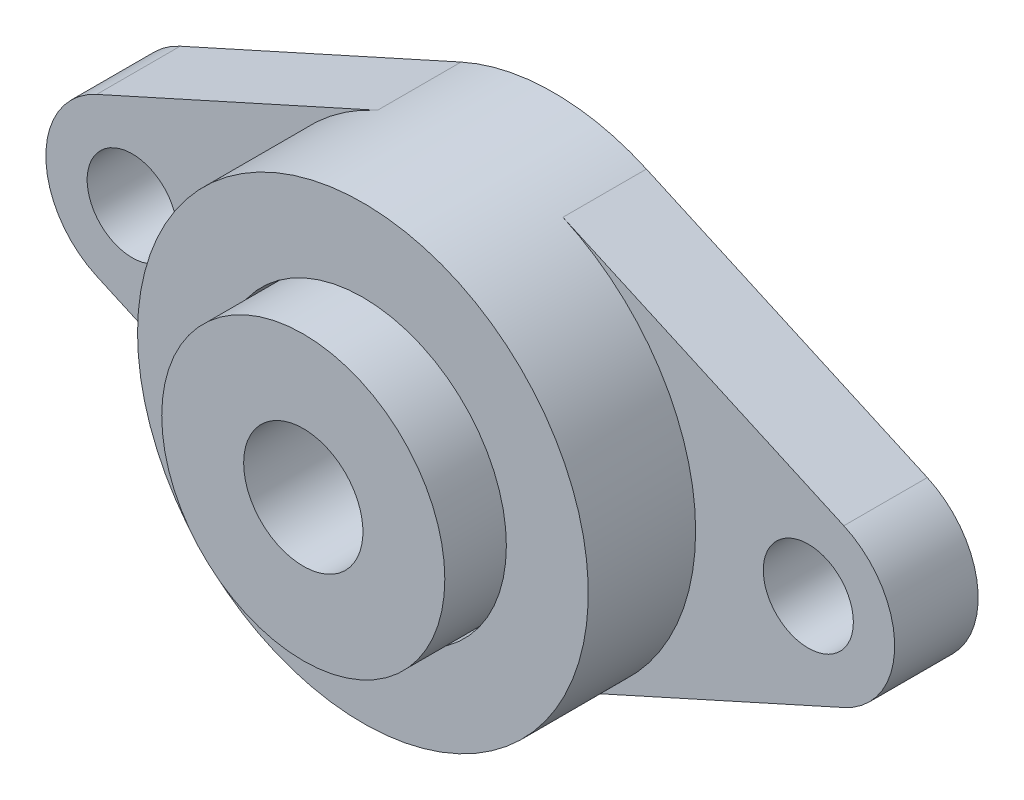
ISO-10303-21;
HEADER;
FILE_DESCRIPTION(('STEP AP214'),'2;1');
FILE_NAME('part.step','',(''),(''),'','','');
FILE_SCHEMA(('AUTOMOTIVE_DESIGN { 1 0 10303 214 1 1 1 1 }'));
ENDSEC;
DATA;
#1=APPLICATION_CONTEXT('core data for automotive mechanical design processes');
#2=APPLICATION_PROTOCOL_DEFINITION('international standard','automotive_design',2000,#1);
#3=PRODUCT_CONTEXT('',#1,'mechanical');
#4=PRODUCT('Part','Part','',(#3));
#5=PRODUCT_RELATED_PRODUCT_CATEGORY('part','',(#4));
#6=PRODUCT_DEFINITION_FORMATION('','',#4);
#7=PRODUCT_DEFINITION_CONTEXT('part definition',#1,'design');
#8=PRODUCT_DEFINITION('design','',#6,#7);
#9=PRODUCT_DEFINITION_SHAPE('','',#8);
#10=(LENGTH_UNIT() NAMED_UNIT(*) SI_UNIT(.MILLI.,.METRE.));
#11=(NAMED_UNIT(*) PLANE_ANGLE_UNIT() SI_UNIT($,.RADIAN.));
#12=(NAMED_UNIT(*) SI_UNIT($,.STERADIAN.) SOLID_ANGLE_UNIT());
#13=UNCERTAINTY_MEASURE_WITH_UNIT(LENGTH_MEASURE(1.E-05),#10,'distance_accuracy_value','');
#14=(GEOMETRIC_REPRESENTATION_CONTEXT(3) GLOBAL_UNCERTAINTY_ASSIGNED_CONTEXT((#13)) GLOBAL_UNIT_ASSIGNED_CONTEXT((#10,
#11,#12)) REPRESENTATION_CONTEXT('',''));
#15=CARTESIAN_POINT('',(0.,0.,0.));
#16=DIRECTION('',(0.,0.,1.));
#17=DIRECTION('',(1.,0.,0.));
#18=AXIS2_PLACEMENT_3D('',#15,#16,#17);
#19=CARTESIAN_POINT('',(0.,18.84045,33.3375));
#20=DIRECTION('',(0.,0.,1.));
#21=DIRECTION('',(1.,0.,0.));
#22=AXIS2_PLACEMENT_3D('',#19,#20,#21);
#23=PLANE('',#22);
#24=CARTESIAN_POINT('',(0.,0.,33.3375));
#25=DIRECTION('',(0.,0.,-1.));
#26=DIRECTION('',(-1.,0.,0.));
#27=AXIS2_PLACEMENT_3D('',#24,#25,#26);
#28=CIRCLE('',#27,7.9375);
#29=CARTESIAN_POINT('',(-7.9375,0.,33.3375));
#30=VERTEX_POINT('',#29);
#31=EDGE_CURVE('E11',#30,#30,#28,.T.);
#32=ORIENTED_EDGE('',*,*,#31,.T.);
#33=EDGE_LOOP('',(#32));
#34=FACE_BOUND('',#33,.T.);
#35=CARTESIAN_POINT('',(0.,0.,33.3375));
#36=DIRECTION('',(0.,0.,-1.));
#37=DIRECTION('',(-1.,0.,0.));
#38=AXIS2_PLACEMENT_3D('',#35,#36,#37);
#39=CIRCLE('',#38,18.84045);
#40=CARTESIAN_POINT('',(-18.84045,0.,33.3375));
#41=VERTEX_POINT('',#40);
#42=EDGE_CURVE('E75',#41,#41,#39,.T.);
#43=ORIENTED_EDGE('',*,*,#42,.F.);
#44=EDGE_LOOP('',(#43));
#45=FACE_BOUND('',#44,.T.);
#46=ADVANCED_FACE('F53',(#34,#45),#23,.T.);
#47=CARTESIAN_POINT('',(0.,0.,0.));
#48=DIRECTION('',(0.,0.,-1.));
#49=DIRECTION('',(-1.,0.,0.));
#50=AXIS2_PLACEMENT_3D('',#47,#48,#49);
#51=CYLINDRICAL_SURFACE('',#50,7.9375);
#52=CARTESIAN_POINT('',(0.,0.,1.5875));
#53=DIRECTION('',(0.,0.,-1.));
#54=DIRECTION('',(-1.,0.,0.));
#55=AXIS2_PLACEMENT_3D('',#52,#53,#54);
#56=CIRCLE('',#55,7.9375);
#57=CARTESIAN_POINT('',(-7.9375,0.,1.5875));
#58=VERTEX_POINT('',#57);
#59=EDGE_CURVE('E59',#58,#58,#56,.T.);
#60=ORIENTED_EDGE('',*,*,#59,.T.);
#61=EDGE_LOOP('',(#60));
#62=FACE_BOUND('',#61,.T.);
#63=ORIENTED_EDGE('',*,*,#31,.F.);
#64=EDGE_LOOP('',(#63));
#65=FACE_BOUND('',#64,.T.);
#66=ADVANCED_FACE('F83',(#62,#65),#51,.F.);
#67=CARTESIAN_POINT('',(0.,18.84045,1.5875));
#68=DIRECTION('',(0.,0.,-1.));
#69=DIRECTION('',(-1.,0.,0.));
#70=AXIS2_PLACEMENT_3D('',#67,#68,#69);
#71=PLANE('',#70);
#72=CARTESIAN_POINT('',(0.,0.,1.5875));
#73=DIRECTION('',(0.,0.,-1.));
#74=DIRECTION('',(-1.,0.,0.));
#75=AXIS2_PLACEMENT_3D('',#72,#73,#74);
#76=CIRCLE('',#75,18.84045);
#77=CARTESIAN_POINT('',(-18.84045,0.,1.5875));
#78=VERTEX_POINT('',#77);
#79=EDGE_CURVE('E63',#78,#78,#76,.T.);
#80=ORIENTED_EDGE('',*,*,#79,.T.);
#81=EDGE_LOOP('',(#80));
#82=FACE_BOUND('',#81,.T.);
#83=ORIENTED_EDGE('',*,*,#59,.F.);
#84=EDGE_LOOP('',(#83));
#85=FACE_BOUND('',#84,.T.);
#86=ADVANCED_FACE('F87',(#82,#85),#71,.T.);
#87=CARTESIAN_POINT('',(0.,0.,0.));
#88=DIRECTION('',(0.,0.,-1.));
#89=DIRECTION('',(-1.,0.,0.));
#90=AXIS2_PLACEMENT_3D('',#87,#88,#89);
#91=CYLINDRICAL_SURFACE('',#90,18.84045);
#92=CARTESIAN_POINT('',(0.,0.,5.62146652973764));
#93=DIRECTION('',(0.,0.,-1.));
#94=DIRECTION('',(-1.,0.,0.));
#95=AXIS2_PLACEMENT_3D('',#92,#93,#94);
#96=CIRCLE('',#95,18.84045);
#97=CARTESIAN_POINT('',(-18.84045,0.,5.62146652973764));
#98=VERTEX_POINT('',#97);
#99=EDGE_CURVE('E67',#98,#98,#96,.T.);
#100=ORIENTED_EDGE('',*,*,#99,.T.);
#101=EDGE_LOOP('',(#100));
#102=FACE_BOUND('',#101,.T.);
#103=ORIENTED_EDGE('',*,*,#79,.F.);
#104=EDGE_LOOP('',(#103));
#105=FACE_BOUND('',#104,.T.);
#106=ADVANCED_FACE('F91',(#102,#105),#91,.T.);
#107=CARTESIAN_POINT('',(0.,0.,10.31875));
#108=DIRECTION('',(0.,0.,-1.));
#109=DIRECTION('',(-1.,0.,0.));
#110=AXIS2_PLACEMENT_3D('',#107,#108,#109);
#111=TOROIDAL_SURFACE('',#110,18.96745,4.699);
#112=CARTESIAN_POINT('',(0.,0.,15.0160334702624));
#113=DIRECTION('',(0.,0.,-1.));
#114=DIRECTION('',(-1.,0.,0.));
#115=AXIS2_PLACEMENT_3D('',#112,#113,#114);
#116=CIRCLE('',#115,18.84045);
#117=CARTESIAN_POINT('',(-18.84045,0.,15.0160334702624));
#118=VERTEX_POINT('',#117);
#119=EDGE_CURVE('E72',#118,#118,#116,.T.);
#120=ORIENTED_EDGE('',*,*,#119,.T.);
#121=EDGE_LOOP('',(#120));
#122=FACE_BOUND('',#121,.T.);
#123=ORIENTED_EDGE('',*,*,#99,.F.);
#124=EDGE_LOOP('',(#123));
#125=FACE_BOUND('',#124,.T.);
#126=ADVANCED_FACE('F98',(#122,#125),#111,.F.);
#127=CARTESIAN_POINT('',(0.,0.,0.));
#128=DIRECTION('',(0.,0.,-1.));
#129=DIRECTION('',(-1.,0.,0.));
#130=AXIS2_PLACEMENT_3D('',#127,#128,#129);
#131=CYLINDRICAL_SURFACE('',#130,18.84045);
#132=ORIENTED_EDGE('',*,*,#42,.T.);
#133=EDGE_LOOP('',(#132));
#134=FACE_BOUND('',#133,.T.);
#135=ORIENTED_EDGE('',*,*,#119,.F.);
#136=EDGE_LOOP('',(#135));
#137=FACE_BOUND('',#136,.T.);
#138=ADVANCED_FACE('F79',(#134,#137),#131,.T.);
#139=CLOSED_SHELL('',(#46,#66,#86,#106,#126,#138));
#140=MANIFOLD_SOLID_BREP('B2',#139);
#141=CARTESIAN_POINT('',(0.,0.,0.));
#142=DIRECTION('',(0.,0.,-1.));
#143=DIRECTION('',(-1.,0.,0.));
#144=AXIS2_PLACEMENT_3D('',#141,#142,#143);
#145=CYLINDRICAL_SURFACE('',#144,29.9974);
#146=CARTESIAN_POINT('',(0.,0.,25.4));
#147=DIRECTION('',(0.,0.,-1.));
#148=DIRECTION('',(-1.,0.,0.));
#149=AXIS2_PLACEMENT_3D('',#146,#147,#148);
#150=CIRCLE('',#149,29.9974);
#151=CARTESIAN_POINT('',(-29.9974,0.,25.4));
#152=VERTEX_POINT('',#151);
#153=EDGE_CURVE('E255',#152,#152,#150,.T.);
#154=ORIENTED_EDGE('',*,*,#153,.T.);
#155=EDGE_LOOP('',(#154));
#156=FACE_BOUND('',#155,.T.);
#157=CARTESIAN_POINT('',(0.,0.,0.));
#158=DIRECTION('',(0.,0.,-1.));
#159=DIRECTION('',(-1.,0.,0.));
#160=AXIS2_PLACEMENT_3D('',#157,#158,#159);
#161=CIRCLE('',#160,29.9974);
#162=CARTESIAN_POINT('',(-12.3359333333333,27.3435322435774,0.));
#163=VERTEX_POINT('',#162);
#164=CARTESIAN_POINT('',(12.3359333333333,27.3435322435774,0.));
#165=VERTEX_POINT('',#164);
#166=EDGE_CURVE('E166',#163,#165,#161,.T.);
#167=ORIENTED_EDGE('',*,*,#166,.F.);
#168=DIRECTION('',(0.,0.,-1.));
#169=VECTOR('',#168,1.);
#170=CARTESIAN_POINT('',(-12.3359333333333,27.3435322435774,11.1125));
#171=LINE('',#170,#169);
#172=CARTESIAN_POINT('',(-12.3359333333333,27.3435322435774,11.1125));
#173=VERTEX_POINT('',#172);
#174=EDGE_CURVE('E161',#173,#163,#171,.T.);
#175=ORIENTED_EDGE('',*,*,#174,.F.);
#176=CARTESIAN_POINT('',(0.,0.,11.1125));
#177=DIRECTION('',(0.,0.,-1.));
#178=DIRECTION('',(1.,0.,0.));
#179=AXIS2_PLACEMENT_3D('',#176,#177,#178);
#180=CIRCLE('',#179,29.9974);
#181=CARTESIAN_POINT('',(-12.3359333333333,-27.3435322435774,11.1125));
#182=VERTEX_POINT('',#181);
#183=EDGE_CURVE('E234',#182,#173,#180,.T.);
#184=ORIENTED_EDGE('',*,*,#183,.F.);
#185=DIRECTION('',(0.,0.,-1.));
#186=VECTOR('',#185,1.);
#187=CARTESIAN_POINT('',(-12.3359333333333,-27.3435322435774,11.1125));
#188=LINE('',#187,#186);
#189=CARTESIAN_POINT('',(-12.3359333333333,-27.3435322435774,0.));
#190=VERTEX_POINT('',#189);
#191=EDGE_CURVE('E216',#182,#190,#188,.T.);
#192=ORIENTED_EDGE('',*,*,#191,.T.);
#193=CARTESIAN_POINT('',(12.3359333333333,-27.3435322435774,0.));
#194=VERTEX_POINT('',#193);
#195=EDGE_CURVE('E258',#194,#190,#161,.T.);
#196=ORIENTED_EDGE('',*,*,#195,.F.);
#197=DIRECTION('',(0.,0.,-1.));
#198=VECTOR('',#197,1.);
#199=CARTESIAN_POINT('',(12.3359333333333,-27.3435322435774,11.1125));
#200=LINE('',#199,#198);
#201=CARTESIAN_POINT('',(12.3359333333333,-27.3435322435774,11.1125));
#202=VERTEX_POINT('',#201);
#203=EDGE_CURVE('E269',#202,#194,#200,.T.);
#204=ORIENTED_EDGE('',*,*,#203,.F.);
#205=CARTESIAN_POINT('',(0.,0.,11.1125));
#206=DIRECTION('',(0.,0.,-1.));
#207=DIRECTION('',(-1.,0.,0.));
#208=AXIS2_PLACEMENT_3D('',#205,#206,#207);
#209=CIRCLE('',#208,29.9974);
#210=CARTESIAN_POINT('',(12.3359333333333,27.3435322435774,11.1125));
#211=VERTEX_POINT('',#210);
#212=EDGE_CURVE('E51',#211,#202,#209,.T.);
#213=ORIENTED_EDGE('',*,*,#212,.F.);
#214=DIRECTION('',(0.,0.,-1.));
#215=VECTOR('',#214,1.);
#216=CARTESIAN_POINT('',(12.3359333333333,27.3435322435774,11.1125));
#217=LINE('',#216,#215);
#218=EDGE_CURVE('E276',#211,#165,#217,.T.);
#219=ORIENTED_EDGE('',*,*,#218,.T.);
#220=EDGE_LOOP('',(#167,#175,#184,#192,#196,#204,#213,#219));
#221=FACE_BOUND('',#220,.T.);
#222=ADVANCED_FACE('F145',(#156,#221),#145,.T.);
#223=CARTESIAN_POINT('',(44.9961,0.,11.1125));
#224=DIRECTION('',(0.,0.,-1.));
#225=DIRECTION('',(-1.,0.,0.));
#226=AXIS2_PLACEMENT_3D('',#223,#224,#225);
#227=CYLINDRICAL_SURFACE('',#226,11.4935);
#228=CARTESIAN_POINT('',(44.9961,0.,11.1125));
#229=DIRECTION('',(0.,0.,1.));
#230=DIRECTION('',(1.,0.,0.));
#231=AXIS2_PLACEMENT_3D('',#228,#229,#230);
#232=CIRCLE('',#231,11.4935);
#233=CARTESIAN_POINT('',(49.7226112898673,-10.4766709061971,11.1125));
#234=VERTEX_POINT('',#233);
#235=CARTESIAN_POINT('',(49.7226112898673,10.4766709061971,11.1125));
#236=VERTEX_POINT('',#235);
#237=EDGE_CURVE('E154',#234,#236,#232,.T.);
#238=ORIENTED_EDGE('',*,*,#237,.F.);
#239=DIRECTION('',(0.,0.,-1.));
#240=VECTOR('',#239,1.);
#241=CARTESIAN_POINT('',(49.7226112898673,-10.4766709061971,11.1125));
#242=LINE('',#241,#240);
#243=CARTESIAN_POINT('',(49.7226112898673,-10.4766709061971,0.));
#244=VERTEX_POINT('',#243);
#245=EDGE_CURVE('E265',#234,#244,#242,.T.);
#246=ORIENTED_EDGE('',*,*,#245,.T.);
#247=CARTESIAN_POINT('',(44.9961,0.,0.));
#248=DIRECTION('',(0.,0.,1.));
#249=DIRECTION('',(1.,0.,0.));
#250=AXIS2_PLACEMENT_3D('',#247,#248,#249);
#251=CIRCLE('',#250,11.4935);
#252=CARTESIAN_POINT('',(49.7226112898673,10.4766709061971,0.));
#253=VERTEX_POINT('',#252);
#254=EDGE_CURVE('E149',#244,#253,#251,.T.);
#255=ORIENTED_EDGE('',*,*,#254,.T.);
#256=DIRECTION('',(0.,0.,-1.));
#257=VECTOR('',#256,1.);
#258=CARTESIAN_POINT('',(49.7226112898673,10.4766709061971,11.1125));
#259=LINE('',#258,#257);
#260=EDGE_CURVE('E280',#236,#253,#259,.T.);
#261=ORIENTED_EDGE('',*,*,#260,.F.);
#262=EDGE_LOOP('',(#238,#246,#255,#261));
#263=FACE_BOUND('',#262,.T.);
#264=ADVANCED_FACE('F147',(#263),#227,.T.);
#265=CARTESIAN_POINT('',(44.9961,0.,11.1125));
#266=DIRECTION('',(0.,0.,1.));
#267=DIRECTION('',(1.,0.,0.));
#268=AXIS2_PLACEMENT_3D('',#265,#266,#267);
#269=PLANE('',#268);
#270=DIRECTION('',(0.911530074058998,0.411233418007338,0.));
#271=VECTOR('',#270,1.);
#272=CARTESIAN_POINT('',(49.7226112898673,-10.4766709061971,11.1125));
#273=LINE('',#272,#271);
#274=EDGE_CURVE('E262',#202,#234,#273,.T.);
#275=ORIENTED_EDGE('',*,*,#274,.T.);
#276=ORIENTED_EDGE('',*,*,#237,.T.);
#277=DIRECTION('',(-0.911530074058997,0.411233418007339,0.));
#278=VECTOR('',#277,1.);
#279=CARTESIAN_POINT('',(12.3359333333333,27.3435322435774,11.1125));
#280=LINE('',#279,#278);
#281=EDGE_CURVE('E273',#236,#211,#280,.T.);
#282=ORIENTED_EDGE('',*,*,#281,.T.);
#283=ORIENTED_EDGE('',*,*,#212,.T.);
#284=EDGE_LOOP('',(#275,#276,#282,#283));
#285=FACE_BOUND('',#284,.T.);
#286=CARTESIAN_POINT('',(44.9961,0.,11.1125));
#287=DIRECTION('',(0.,0.,1.));
#288=DIRECTION('',(1.,0.,0.));
#289=AXIS2_PLACEMENT_3D('',#286,#287,#288);
#290=CIRCLE('',#289,5.9944);
#291=CARTESIAN_POINT('',(50.9905,0.,11.1125));
#292=VERTEX_POINT('',#291);
#293=EDGE_CURVE('E284',#292,#292,#290,.T.);
#294=ORIENTED_EDGE('',*,*,#293,.F.);
#295=EDGE_LOOP('',(#294));
#296=FACE_BOUND('',#295,.T.);
#297=ADVANCED_FACE('F306',(#285,#296),#269,.T.);
#298=CARTESIAN_POINT('',(44.9961,0.,0.));
#299=DIRECTION('',(0.,0.,1.));
#300=DIRECTION('',(1.,0.,0.));
#301=AXIS2_PLACEMENT_3D('',#298,#299,#300);
#302=PLANE('',#301);
#303=ORIENTED_EDGE('',*,*,#254,.F.);
#304=DIRECTION('',(0.911530074058998,0.411233418007338,0.));
#305=VECTOR('',#304,1.);
#306=CARTESIAN_POINT('',(49.7226112898673,-10.4766709061971,0.));
#307=LINE('',#306,#305);
#308=EDGE_CURVE('E261',#194,#244,#307,.T.);
#309=ORIENTED_EDGE('',*,*,#308,.F.);
#310=ORIENTED_EDGE('',*,*,#195,.T.);
#311=DIRECTION('',(0.911530074058998,-0.411233418007338,0.));
#312=VECTOR('',#311,1.);
#313=CARTESIAN_POINT('',(-12.3359333333333,-27.3435322435774,0.));
#314=LINE('',#313,#312);
#315=CARTESIAN_POINT('',(-49.7226112898673,-10.4766709061971,0.));
#316=VERTEX_POINT('',#315);
#317=EDGE_CURVE('E219',#316,#190,#314,.T.);
#318=ORIENTED_EDGE('',*,*,#317,.F.);
#319=CARTESIAN_POINT('',(-44.9961,0.,0.));
#320=DIRECTION('',(0.,0.,1.));
#321=DIRECTION('',(1.,0.,0.));
#322=AXIS2_PLACEMENT_3D('',#319,#320,#321);
#323=CIRCLE('',#322,11.4935);
#324=CARTESIAN_POINT('',(-49.7226112898673,10.4766709061971,0.));
#325=VERTEX_POINT('',#324);
#326=EDGE_CURVE('E226',#325,#316,#323,.T.);
#327=ORIENTED_EDGE('',*,*,#326,.F.);
#328=DIRECTION('',(-0.911530074058997,-0.411233418007339,0.));
#329=VECTOR('',#328,1.);
#330=CARTESIAN_POINT('',(-49.7226112898673,10.4766709061971,0.));
#331=LINE('',#330,#329);
#332=EDGE_CURVE('E227',#163,#325,#331,.T.);
#333=ORIENTED_EDGE('',*,*,#332,.F.);
#334=ORIENTED_EDGE('',*,*,#166,.T.);
#335=DIRECTION('',(-0.911530074058997,0.411233418007339,0.));
#336=VECTOR('',#335,1.);
#337=CARTESIAN_POINT('',(12.3359333333333,27.3435322435774,0.));
#338=LINE('',#337,#336);
#339=EDGE_CURVE('E272',#253,#165,#338,.T.);
#340=ORIENTED_EDGE('',*,*,#339,.F.);
#341=EDGE_LOOP('',(#303,#309,#310,#318,#327,#333,#334,#340));
#342=FACE_BOUND('',#341,.T.);
#343=CARTESIAN_POINT('',(44.9961,0.,0.));
#344=DIRECTION('',(0.,0.,1.));
#345=DIRECTION('',(1.,0.,0.));
#346=AXIS2_PLACEMENT_3D('',#343,#344,#345);
#347=CIRCLE('',#346,5.9944);
#348=CARTESIAN_POINT('',(50.9905,0.,0.));
#349=VERTEX_POINT('',#348);
#350=EDGE_CURVE('E283',#349,#349,#347,.T.);
#351=ORIENTED_EDGE('',*,*,#350,.T.);
#352=EDGE_LOOP('',(#351));
#353=FACE_BOUND('',#352,.T.);
#354=CARTESIAN_POINT('',(0.,0.,0.));
#355=DIRECTION('',(0.,0.,-1.));
#356=DIRECTION('',(-1.,0.,0.));
#357=AXIS2_PLACEMENT_3D('',#354,#355,#356);
#358=CIRCLE('',#357,19.09445);
#359=CARTESIAN_POINT('',(-19.09445,0.,0.));
#360=VERTEX_POINT('',#359);
#361=EDGE_CURVE('E236',#360,#360,#358,.T.);
#362=ORIENTED_EDGE('',*,*,#361,.F.);
#363=EDGE_LOOP('',(#362));
#364=FACE_BOUND('',#363,.T.);
#365=CARTESIAN_POINT('',(-44.9961,0.,0.));
#366=DIRECTION('',(0.,0.,1.));
#367=DIRECTION('',(1.,0.,0.));
#368=AXIS2_PLACEMENT_3D('',#365,#366,#367);
#369=CIRCLE('',#368,5.9944);
#370=CARTESIAN_POINT('',(-39.0017,0.,0.));
#371=VERTEX_POINT('',#370);
#372=EDGE_CURVE('E241',#371,#371,#369,.T.);
#373=ORIENTED_EDGE('',*,*,#372,.T.);
#374=EDGE_LOOP('',(#373));
#375=FACE_BOUND('',#374,.T.);
#376=ADVANCED_FACE('F301',(#342,#353,#364,#375),#302,.F.);
#377=CARTESIAN_POINT('',(44.9961,0.,11.1125));
#378=DIRECTION('',(0.,0.,-1.));
#379=DIRECTION('',(-1.,0.,0.));
#380=AXIS2_PLACEMENT_3D('',#377,#378,#379);
#381=CYLINDRICAL_SURFACE('',#380,5.9944);
#382=ORIENTED_EDGE('',*,*,#293,.T.);
#383=EDGE_LOOP('',(#382));
#384=FACE_BOUND('',#383,.T.);
#385=ORIENTED_EDGE('',*,*,#350,.F.);
#386=EDGE_LOOP('',(#385));
#387=FACE_BOUND('',#386,.T.);
#388=ADVANCED_FACE('F312',(#384,#387),#381,.F.);
#389=CARTESIAN_POINT('',(12.3359333333333,27.3435322435774,11.1125));
#390=DIRECTION('',(-0.411233418007339,-0.911530074058998,0.));
#391=DIRECTION('',(0.911530074058998,-0.411233418007339,0.));
#392=AXIS2_PLACEMENT_3D('',#389,#390,#391);
#393=PLANE('',#392);
#394=ORIENTED_EDGE('',*,*,#339,.T.);
#395=ORIENTED_EDGE('',*,*,#218,.F.);
#396=ORIENTED_EDGE('',*,*,#281,.F.);
#397=ORIENTED_EDGE('',*,*,#260,.T.);
#398=EDGE_LOOP('',(#394,#395,#396,#397));
#399=FACE_BOUND('',#398,.T.);
#400=ADVANCED_FACE('F299',(#399),#393,.F.);
#401=CARTESIAN_POINT('',(49.7226112898673,-10.4766709061971,11.1125));
#402=DIRECTION('',(-0.411233418007338,0.911530074058997,0.));
#403=DIRECTION('',(-0.911530074058998,-0.411233418007338,0.));
#404=AXIS2_PLACEMENT_3D('',#401,#402,#403);
#405=PLANE('',#404);
#406=ORIENTED_EDGE('',*,*,#308,.T.);
#407=ORIENTED_EDGE('',*,*,#245,.F.);
#408=ORIENTED_EDGE('',*,*,#274,.F.);
#409=ORIENTED_EDGE('',*,*,#203,.T.);
#410=EDGE_LOOP('',(#406,#407,#408,#409));
#411=FACE_BOUND('',#410,.T.);
#412=ADVANCED_FACE('F334',(#411),#405,.F.);
#413=CARTESIAN_POINT('',(0.,29.9974,25.4));
#414=DIRECTION('',(0.,0.,1.));
#415=DIRECTION('',(1.,0.,0.));
#416=AXIS2_PLACEMENT_3D('',#413,#414,#415);
#417=PLANE('',#416);
#418=CARTESIAN_POINT('',(0.,0.,25.4));
#419=DIRECTION('',(0.,0.,-1.));
#420=DIRECTION('',(-1.,0.,0.));
#421=AXIS2_PLACEMENT_3D('',#418,#419,#420);
#422=CIRCLE('',#421,19.09445);
#423=CARTESIAN_POINT('',(-19.09445,0.,25.4));
#424=VERTEX_POINT('',#423);
#425=EDGE_CURVE('E252',#424,#424,#422,.T.);
#426=ORIENTED_EDGE('',*,*,#425,.T.);
#427=EDGE_LOOP('',(#426));
#428=FACE_BOUND('',#427,.T.);
#429=ORIENTED_EDGE('',*,*,#153,.F.);
#430=EDGE_LOOP('',(#429));
#431=FACE_BOUND('',#430,.T.);
#432=ADVANCED_FACE('F336',(#428,#431),#417,.T.);
#433=CARTESIAN_POINT('',(0.,0.,0.));
#434=DIRECTION('',(0.,0.,-1.));
#435=DIRECTION('',(-1.,0.,0.));
#436=AXIS2_PLACEMENT_3D('',#433,#434,#435);
#437=CYLINDRICAL_SURFACE('',#436,19.09445);
#438=CARTESIAN_POINT('',(0.,0.,15.0160334702624));
#439=DIRECTION('',(0.,0.,-1.));
#440=DIRECTION('',(-1.,0.,0.));
#441=AXIS2_PLACEMENT_3D('',#438,#439,#440);
#442=CIRCLE('',#441,19.09445);
#443=CARTESIAN_POINT('',(-19.09445,0.,15.0160334702624));
#444=VERTEX_POINT('',#443);
#445=EDGE_CURVE('E249',#444,#444,#442,.T.);
#446=ORIENTED_EDGE('',*,*,#445,.T.);
#447=EDGE_LOOP('',(#446));
#448=FACE_BOUND('',#447,.T.);
#449=ORIENTED_EDGE('',*,*,#425,.F.);
#450=EDGE_LOOP('',(#449));
#451=FACE_BOUND('',#450,.T.);
#452=ADVANCED_FACE('F342',(#448,#451),#437,.F.);
#453=CARTESIAN_POINT('',(0.,0.,10.31875));
#454=DIRECTION('',(0.,0.,-1.));
#455=DIRECTION('',(-1.,0.,0.));
#456=AXIS2_PLACEMENT_3D('',#453,#454,#455);
#457=TOROIDAL_SURFACE('',#456,18.96745,4.699);
#458=CARTESIAN_POINT('',(0.,0.,5.62146652973764));
#459=DIRECTION('',(0.,0.,-1.));
#460=DIRECTION('',(-1.,0.,0.));
#461=AXIS2_PLACEMENT_3D('',#458,#459,#460);
#462=CIRCLE('',#461,19.09445);
#463=CARTESIAN_POINT('',(-19.09445,0.,5.62146652973764));
#464=VERTEX_POINT('',#463);
#465=EDGE_CURVE('E246',#464,#464,#462,.T.);
#466=ORIENTED_EDGE('',*,*,#465,.T.);
#467=EDGE_LOOP('',(#466));
#468=FACE_BOUND('',#467,.T.);
#469=ORIENTED_EDGE('',*,*,#445,.F.);
#470=EDGE_LOOP('',(#469));
#471=FACE_BOUND('',#470,.T.);
#472=ADVANCED_FACE('F355',(#468,#471),#457,.F.);
#473=CARTESIAN_POINT('',(0.,0.,0.));
#474=DIRECTION('',(0.,0.,-1.));
#475=DIRECTION('',(-1.,0.,0.));
#476=AXIS2_PLACEMENT_3D('',#473,#474,#475);
#477=CYLINDRICAL_SURFACE('',#476,19.09445);
#478=ORIENTED_EDGE('',*,*,#361,.T.);
#479=EDGE_LOOP('',(#478));
#480=FACE_BOUND('',#479,.T.);
#481=ORIENTED_EDGE('',*,*,#465,.F.);
#482=EDGE_LOOP('',(#481));
#483=FACE_BOUND('',#482,.T.);
#484=ADVANCED_FACE('F359',(#480,#483),#477,.F.);
#485=CARTESIAN_POINT('',(-44.9961,0.,11.1125));
#486=DIRECTION('',(0.,0.,-1.));
#487=DIRECTION('',(-1.,0.,0.));
#488=AXIS2_PLACEMENT_3D('',#485,#486,#487);
#489=CYLINDRICAL_SURFACE('',#488,11.4935);
#490=DIRECTION('',(0.,0.,-1.));
#491=VECTOR('',#490,1.);
#492=CARTESIAN_POINT('',(-49.7226112898673,-10.4766709061971,11.1125));
#493=LINE('',#492,#491);
#494=CARTESIAN_POINT('',(-49.7226112898673,-10.4766709061971,11.1125));
#495=VERTEX_POINT('',#494);
#496=EDGE_CURVE('E214',#495,#316,#493,.T.);
#497=ORIENTED_EDGE('',*,*,#496,.F.);
#498=CARTESIAN_POINT('',(-44.9961,0.,11.1125));
#499=DIRECTION('',(0.,0.,1.));
#500=DIRECTION('',(1.,0.,0.));
#501=AXIS2_PLACEMENT_3D('',#498,#499,#500);
#502=CIRCLE('',#501,11.4935);
#503=CARTESIAN_POINT('',(-49.7226112898673,10.4766709061971,11.1125));
#504=VERTEX_POINT('',#503);
#505=EDGE_CURVE('E223',#504,#495,#502,.T.);
#506=ORIENTED_EDGE('',*,*,#505,.F.);
#507=DIRECTION('',(0.,0.,-1.));
#508=VECTOR('',#507,1.);
#509=CARTESIAN_POINT('',(-49.7226112898673,10.4766709061971,11.1125));
#510=LINE('',#509,#508);
#511=EDGE_CURVE('E325',#504,#325,#510,.T.);
#512=ORIENTED_EDGE('',*,*,#511,.T.);
#513=ORIENTED_EDGE('',*,*,#326,.T.);
#514=EDGE_LOOP('',(#497,#506,#512,#513));
#515=FACE_BOUND('',#514,.T.);
#516=ADVANCED_FACE('F222',(#515),#489,.T.);
#517=CARTESIAN_POINT('',(-44.9961,0.,11.1125));
#518=DIRECTION('',(0.,0.,1.));
#519=DIRECTION('',(1.,0.,0.));
#520=AXIS2_PLACEMENT_3D('',#517,#518,#519);
#521=PLANE('',#520);
#522=ORIENTED_EDGE('',*,*,#505,.T.);
#523=DIRECTION('',(0.911530074058998,-0.411233418007338,0.));
#524=VECTOR('',#523,1.);
#525=CARTESIAN_POINT('',(-12.3359333333333,-27.3435322435774,11.1125));
#526=LINE('',#525,#524);
#527=EDGE_CURVE('E210',#495,#182,#526,.T.);
#528=ORIENTED_EDGE('',*,*,#527,.T.);
#529=ORIENTED_EDGE('',*,*,#183,.T.);
#530=DIRECTION('',(-0.911530074058997,-0.411233418007339,0.));
#531=VECTOR('',#530,1.);
#532=CARTESIAN_POINT('',(-49.7226112898673,10.4766709061971,11.1125));
#533=LINE('',#532,#531);
#534=EDGE_CURVE('E232',#173,#504,#533,.T.);
#535=ORIENTED_EDGE('',*,*,#534,.T.);
#536=EDGE_LOOP('',(#522,#528,#529,#535));
#537=FACE_BOUND('',#536,.T.);
#538=CARTESIAN_POINT('',(-44.9961,0.,11.1125));
#539=DIRECTION('',(0.,0.,1.));
#540=DIRECTION('',(1.,0.,0.));
#541=AXIS2_PLACEMENT_3D('',#538,#539,#540);
#542=CIRCLE('',#541,5.9944);
#543=CARTESIAN_POINT('',(-39.0017,0.,11.1125));
#544=VERTEX_POINT('',#543);
#545=EDGE_CURVE('E238',#544,#544,#542,.T.);
#546=ORIENTED_EDGE('',*,*,#545,.F.);
#547=EDGE_LOOP('',(#546));
#548=FACE_BOUND('',#547,.T.);
#549=ADVANCED_FACE('F229',(#537,#548),#521,.T.);
#550=CARTESIAN_POINT('',(-44.9961,0.,11.1125));
#551=DIRECTION('',(0.,0.,-1.));
#552=DIRECTION('',(-1.,0.,0.));
#553=AXIS2_PLACEMENT_3D('',#550,#551,#552);
#554=CYLINDRICAL_SURFACE('',#553,5.9944);
#555=ORIENTED_EDGE('',*,*,#545,.T.);
#556=EDGE_LOOP('',(#555));
#557=FACE_BOUND('',#556,.T.);
#558=ORIENTED_EDGE('',*,*,#372,.F.);
#559=EDGE_LOOP('',(#558));
#560=FACE_BOUND('',#559,.T.);
#561=ADVANCED_FACE('F368',(#557,#560),#554,.F.);
#562=CARTESIAN_POINT('',(-49.7226112898673,10.4766709061971,11.1125));
#563=DIRECTION('',(0.411233418007339,-0.911530074058998,0.));
#564=DIRECTION('',(0.911530074058998,0.411233418007339,0.));
#565=AXIS2_PLACEMENT_3D('',#562,#563,#564);
#566=PLANE('',#565);
#567=ORIENTED_EDGE('',*,*,#332,.T.);
#568=ORIENTED_EDGE('',*,*,#511,.F.);
#569=ORIENTED_EDGE('',*,*,#534,.F.);
#570=ORIENTED_EDGE('',*,*,#174,.T.);
#571=EDGE_LOOP('',(#567,#568,#569,#570));
#572=FACE_BOUND('',#571,.T.);
#573=ADVANCED_FACE('F371',(#572),#566,.F.);
#574=CARTESIAN_POINT('',(-12.3359333333333,-27.3435322435774,11.1125));
#575=DIRECTION('',(0.411233418007338,0.911530074058997,0.));
#576=DIRECTION('',(-0.911530074058998,0.411233418007338,0.));
#577=AXIS2_PLACEMENT_3D('',#574,#575,#576);
#578=PLANE('',#577);
#579=ORIENTED_EDGE('',*,*,#317,.T.);
#580=ORIENTED_EDGE('',*,*,#191,.F.);
#581=ORIENTED_EDGE('',*,*,#527,.F.);
#582=ORIENTED_EDGE('',*,*,#496,.T.);
#583=EDGE_LOOP('',(#579,#580,#581,#582));
#584=FACE_BOUND('',#583,.T.);
#585=ADVANCED_FACE('F213',(#584),#578,.F.);
#586=CLOSED_SHELL('',(#222,#264,#297,#376,#388,#400,#412,#432,#452,#472,#484,#516,#549,#561,
#573,#585));
#587=MANIFOLD_SOLID_BREP('B6',#586);
#588=ADVANCED_BREP_SHAPE_REPRESENTATION('',(#18,#140,#587),#14);
#589=SHAPE_DEFINITION_REPRESENTATION(#9,#588);
ENDSEC;
END-ISO-10303-21;
